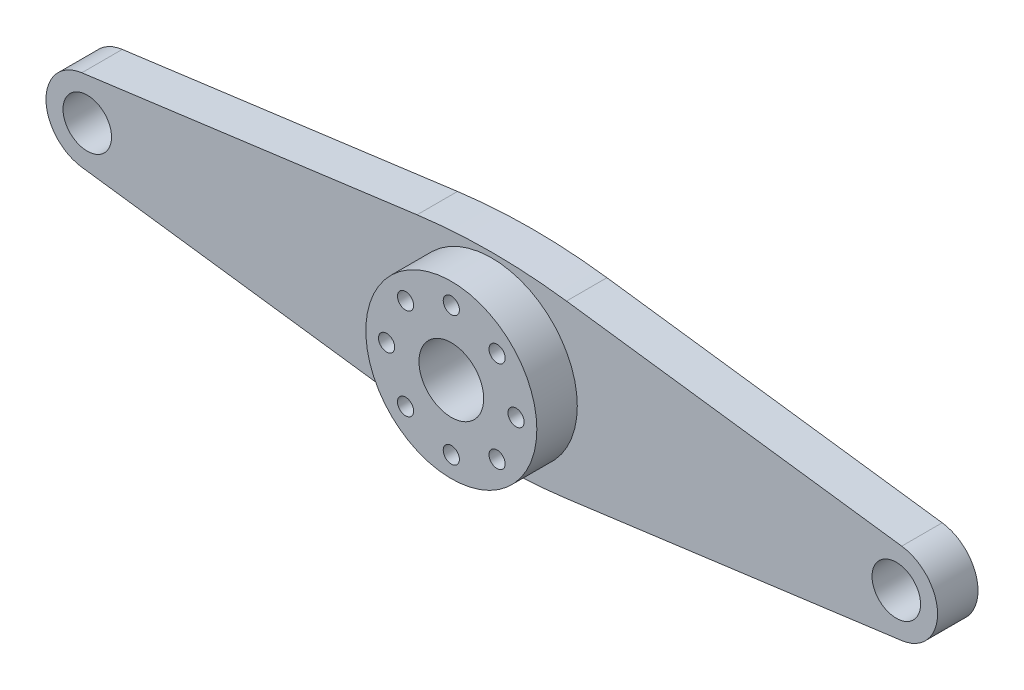
ISO-10303-21;
HEADER;
FILE_DESCRIPTION(('STEP AP214'),'2;1');
FILE_NAME('part.step','',(''),(''),'','','');
FILE_SCHEMA(('AUTOMOTIVE_DESIGN { 1 0 10303 214 1 1 1 1 }'));
ENDSEC;
DATA;
#1=APPLICATION_CONTEXT('core data for automotive mechanical design processes');
#2=APPLICATION_PROTOCOL_DEFINITION('international standard','automotive_design',2000,#1);
#3=PRODUCT_CONTEXT('',#1,'mechanical');
#4=PRODUCT('Part','Part','',(#3));
#5=PRODUCT_RELATED_PRODUCT_CATEGORY('part','',(#4));
#6=PRODUCT_DEFINITION_FORMATION('','',#4);
#7=PRODUCT_DEFINITION_CONTEXT('part definition',#1,'design');
#8=PRODUCT_DEFINITION('design','',#6,#7);
#9=PRODUCT_DEFINITION_SHAPE('','',#8);
#10=(LENGTH_UNIT() NAMED_UNIT(*) SI_UNIT(.MILLI.,.METRE.));
#11=(NAMED_UNIT(*) PLANE_ANGLE_UNIT() SI_UNIT($,.RADIAN.));
#12=(NAMED_UNIT(*) SI_UNIT($,.STERADIAN.) SOLID_ANGLE_UNIT());
#13=UNCERTAINTY_MEASURE_WITH_UNIT(LENGTH_MEASURE(1.E-05),#10,'distance_accuracy_value','');
#14=(GEOMETRIC_REPRESENTATION_CONTEXT(3) GLOBAL_UNCERTAINTY_ASSIGNED_CONTEXT((#13)) GLOBAL_UNIT_ASSIGNED_CONTEXT((#10,
#11,#12)) REPRESENTATION_CONTEXT('',''));
#15=CARTESIAN_POINT('',(0.,0.,0.));
#16=DIRECTION('',(0.,0.,1.));
#17=DIRECTION('',(1.,0.,0.));
#18=AXIS2_PLACEMENT_3D('',#15,#16,#17);
#19=CARTESIAN_POINT('',(-1.54315479575544,-11.5945134987938,5.));
#20=DIRECTION('',(0.131930166805804,0.991259013117456,0.));
#21=DIRECTION('',(-0.991259013117456,0.131930166805804,0.));
#22=AXIS2_PLACEMENT_3D('',#19,#20,#21);
#23=PLANE('',#22);
#24=DIRECTION('',(0.991259013117456,-0.131930166805804,0.));
#25=VECTOR('',#24,1.);
#26=CARTESIAN_POINT('',(-1.54315479575544,-11.5945134987938,0.));
#27=LINE('',#26,#25);
#28=CARTESIAN_POINT('',(-50.6728763500851,-5.05566515137672,0.));
#29=VERTEX_POINT('',#28);
#30=CARTESIAN_POINT('',(-9.23511167640649,-10.5707637614413,0.));
#31=VERTEX_POINT('',#30);
#32=EDGE_CURVE('E135',#29,#31,#27,.T.);
#33=ORIENTED_EDGE('',*,*,#32,.T.);
#34=DIRECTION('',(0.,0.,-1.));
#35=VECTOR('',#34,1.);
#36=CARTESIAN_POINT('',(-9.23511167640649,-10.5707637614413,5.));
#37=LINE('',#36,#35);
#38=CARTESIAN_POINT('',(-9.23511167640649,-10.5707637614413,5.));
#39=VERTEX_POINT('',#38);
#40=EDGE_CURVE('E11',#39,#31,#37,.T.);
#41=ORIENTED_EDGE('',*,*,#40,.F.);
#42=DIRECTION('',(0.991259013117456,-0.131930166805804,0.));
#43=VECTOR('',#42,1.);
#44=CARTESIAN_POINT('',(-1.54315479575544,-11.5945134987938,5.));
#45=LINE('',#44,#43);
#46=CARTESIAN_POINT('',(-50.6728763500851,-5.05566515137672,5.));
#47=VERTEX_POINT('',#46);
#48=EDGE_CURVE('E208',#47,#39,#45,.T.);
#49=ORIENTED_EDGE('',*,*,#48,.F.);
#50=DIRECTION('',(0.,0.,-1.));
#51=VECTOR('',#50,1.);
#52=CARTESIAN_POINT('',(-50.6728763500851,-5.05566515137672,5.));
#53=LINE('',#52,#51);
#54=EDGE_CURVE('E124',#47,#29,#53,.T.);
#55=ORIENTED_EDGE('',*,*,#54,.T.);
#56=EDGE_LOOP('',(#33,#41,#49,#55));
#57=FACE_BOUND('',#56,.T.);
#58=ADVANCED_FACE('F32',(#57),#23,.F.);
#59=CARTESIAN_POINT('',(0.,58.8173671567806,5.));
#60=DIRECTION('',(0.,0.,-1.));
#61=DIRECTION('',(-1.,0.,0.));
#62=AXIS2_PLACEMENT_3D('',#59,#60,#61);
#63=CYLINDRICAL_SURFACE('',#62,70.);
#64=CARTESIAN_POINT('',(0.,58.8173671567806,0.));
#65=DIRECTION('',(0.,0.,1.));
#66=DIRECTION('',(1.,0.,0.));
#67=AXIS2_PLACEMENT_3D('',#64,#65,#66);
#68=CIRCLE('',#67,70.);
#69=CARTESIAN_POINT('',(9.23511167640649,-10.5707637614413,0.));
#70=VERTEX_POINT('',#69);
#71=EDGE_CURVE('E138',#31,#70,#68,.T.);
#72=ORIENTED_EDGE('',*,*,#71,.T.);
#73=DIRECTION('',(0.,0.,-1.));
#74=VECTOR('',#73,1.);
#75=CARTESIAN_POINT('',(9.23511167640649,-10.5707637614413,5.));
#76=LINE('',#75,#74);
#77=CARTESIAN_POINT('',(9.23511167640649,-10.5707637614413,5.));
#78=VERTEX_POINT('',#77);
#79=EDGE_CURVE('E41',#78,#70,#76,.T.);
#80=ORIENTED_EDGE('',*,*,#79,.F.);
#81=CARTESIAN_POINT('',(0.,58.8173671567806,5.));
#82=DIRECTION('',(0.,0.,1.));
#83=DIRECTION('',(1.,0.,0.));
#84=AXIS2_PLACEMENT_3D('',#81,#82,#83);
#85=CIRCLE('',#84,70.);
#86=EDGE_CURVE('E88',#39,#78,#85,.T.);
#87=ORIENTED_EDGE('',*,*,#86,.F.);
#88=ORIENTED_EDGE('',*,*,#40,.T.);
#89=EDGE_LOOP('',(#72,#80,#87,#88));
#90=FACE_BOUND('',#89,.T.);
#91=ADVANCED_FACE('F194',(#90),#63,.T.);
#92=CARTESIAN_POINT('',(1.54315479575544,-11.5945134987938,5.));
#93=DIRECTION('',(0.131930166805804,-0.991259013117456,0.));
#94=DIRECTION('',(0.991259013117456,0.131930166805804,0.));
#95=AXIS2_PLACEMENT_3D('',#92,#93,#94);
#96=PLANE('',#95);
#97=DIRECTION('',(-0.991259013117456,-0.131930166805804,0.));
#98=VECTOR('',#97,1.);
#99=CARTESIAN_POINT('',(1.54315479575544,-11.5945134987938,0.));
#100=LINE('',#99,#98);
#101=CARTESIAN_POINT('',(50.6728763500851,-5.05566515137672,0.));
#102=VERTEX_POINT('',#101);
#103=EDGE_CURVE('E141',#102,#70,#100,.T.);
#104=ORIENTED_EDGE('',*,*,#103,.F.);
#105=DIRECTION('',(0.,0.,-1.));
#106=VECTOR('',#105,1.);
#107=CARTESIAN_POINT('',(50.6728763500851,-5.05566515137672,5.));
#108=LINE('',#107,#106);
#109=CARTESIAN_POINT('',(50.6728763500851,-5.05566515137672,5.));
#110=VERTEX_POINT('',#109);
#111=EDGE_CURVE('E187',#110,#102,#108,.T.);
#112=ORIENTED_EDGE('',*,*,#111,.F.);
#113=DIRECTION('',(-0.991259013117456,-0.131930166805804,0.));
#114=VECTOR('',#113,1.);
#115=CARTESIAN_POINT('',(1.54315479575544,-11.5945134987938,5.));
#116=LINE('',#115,#114);
#117=EDGE_CURVE('E193',#110,#78,#116,.T.);
#118=ORIENTED_EDGE('',*,*,#117,.T.);
#119=ORIENTED_EDGE('',*,*,#79,.T.);
#120=EDGE_LOOP('',(#104,#112,#118,#119));
#121=FACE_BOUND('',#120,.T.);
#122=ADVANCED_FACE('F191',(#121),#96,.T.);
#123=CARTESIAN_POINT('',(50.,0.,5.));
#124=DIRECTION('',(0.,0.,-1.));
#125=DIRECTION('',(-1.,0.,0.));
#126=AXIS2_PLACEMENT_3D('',#123,#124,#125);
#127=CYLINDRICAL_SURFACE('',#126,5.10024633771241);
#128=CARTESIAN_POINT('',(50.,0.,0.));
#129=DIRECTION('',(0.,0.,1.));
#130=DIRECTION('',(1.,0.,0.));
#131=AXIS2_PLACEMENT_3D('',#128,#129,#130);
#132=CIRCLE('',#131,5.10024633771241);
#133=CARTESIAN_POINT('',(50.6728763500851,5.05566515137672,0.));
#134=VERTEX_POINT('',#133);
#135=EDGE_CURVE('E144',#134,#102,#132,.F.);
#136=ORIENTED_EDGE('',*,*,#135,.F.);
#137=DIRECTION('',(0.,0.,-1.));
#138=VECTOR('',#137,1.);
#139=CARTESIAN_POINT('',(50.6728763500851,5.05566515137672,5.));
#140=LINE('',#139,#138);
#141=CARTESIAN_POINT('',(50.6728763500851,5.05566515137672,5.));
#142=VERTEX_POINT('',#141);
#143=EDGE_CURVE('E185',#142,#134,#140,.T.);
#144=ORIENTED_EDGE('',*,*,#143,.F.);
#145=CARTESIAN_POINT('',(50.,0.,5.));
#146=DIRECTION('',(0.,0.,1.));
#147=DIRECTION('',(1.,0.,0.));
#148=AXIS2_PLACEMENT_3D('',#145,#146,#147);
#149=CIRCLE('',#148,5.10024633771241);
#150=EDGE_CURVE('E205',#142,#110,#149,.F.);
#151=ORIENTED_EDGE('',*,*,#150,.T.);
#152=ORIENTED_EDGE('',*,*,#111,.T.);
#153=EDGE_LOOP('',(#136,#144,#151,#152));
#154=FACE_BOUND('',#153,.T.);
#155=ADVANCED_FACE('F203',(#154),#127,.T.);
#156=CARTESIAN_POINT('',(1.54315479575544,11.5945134987938,5.));
#157=DIRECTION('',(-0.131930166805804,-0.991259013117456,0.));
#158=DIRECTION('',(0.991259013117456,-0.131930166805804,0.));
#159=AXIS2_PLACEMENT_3D('',#156,#157,#158);
#160=PLANE('',#159);
#161=DIRECTION('',(-0.991259013117456,0.131930166805804,0.));
#162=VECTOR('',#161,1.);
#163=CARTESIAN_POINT('',(1.54315479575544,11.5945134987938,0.));
#164=LINE('',#163,#162);
#165=CARTESIAN_POINT('',(9.23511167640649,10.5707637614413,0.));
#166=VERTEX_POINT('',#165);
#167=EDGE_CURVE('E147',#134,#166,#164,.T.);
#168=ORIENTED_EDGE('',*,*,#167,.T.);
#169=DIRECTION('',(0.,0.,-1.));
#170=VECTOR('',#169,1.);
#171=CARTESIAN_POINT('',(9.23511167640649,10.5707637614413,5.));
#172=LINE('',#171,#170);
#173=CARTESIAN_POINT('',(9.23511167640649,10.5707637614413,5.));
#174=VERTEX_POINT('',#173);
#175=EDGE_CURVE('E113',#174,#166,#172,.T.);
#176=ORIENTED_EDGE('',*,*,#175,.F.);
#177=DIRECTION('',(-0.991259013117456,0.131930166805804,0.));
#178=VECTOR('',#177,1.);
#179=CARTESIAN_POINT('',(1.54315479575544,11.5945134987938,5.));
#180=LINE('',#179,#178);
#181=EDGE_CURVE('E119',#142,#174,#180,.T.);
#182=ORIENTED_EDGE('',*,*,#181,.F.);
#183=ORIENTED_EDGE('',*,*,#143,.T.);
#184=EDGE_LOOP('',(#168,#176,#182,#183));
#185=FACE_BOUND('',#184,.T.);
#186=ADVANCED_FACE('F353',(#185),#160,.F.);
#187=CARTESIAN_POINT('',(0.,-58.8173671567806,5.));
#188=DIRECTION('',(0.,0.,-1.));
#189=DIRECTION('',(-1.,0.,0.));
#190=AXIS2_PLACEMENT_3D('',#187,#188,#189);
#191=CYLINDRICAL_SURFACE('',#190,70.);
#192=CARTESIAN_POINT('',(0.,-58.8173671567806,0.));
#193=DIRECTION('',(0.,0.,1.));
#194=DIRECTION('',(1.,0.,0.));
#195=AXIS2_PLACEMENT_3D('',#192,#193,#194);
#196=CIRCLE('',#195,70.);
#197=CARTESIAN_POINT('',(-9.23511167640649,10.5707637614413,0.));
#198=VERTEX_POINT('',#197);
#199=EDGE_CURVE('E108',#198,#166,#196,.F.);
#200=ORIENTED_EDGE('',*,*,#199,.F.);
#201=DIRECTION('',(0.,0.,-1.));
#202=VECTOR('',#201,1.);
#203=CARTESIAN_POINT('',(-9.23511167640649,10.5707637614413,5.));
#204=LINE('',#203,#202);
#205=CARTESIAN_POINT('',(-9.23511167640649,10.5707637614413,5.));
#206=VERTEX_POINT('',#205);
#207=EDGE_CURVE('E103',#206,#198,#204,.T.);
#208=ORIENTED_EDGE('',*,*,#207,.F.);
#209=CARTESIAN_POINT('',(0.,-58.8173671567806,5.));
#210=DIRECTION('',(0.,0.,1.));
#211=DIRECTION('',(1.,0.,0.));
#212=AXIS2_PLACEMENT_3D('',#209,#210,#211);
#213=CIRCLE('',#212,70.);
#214=EDGE_CURVE('E106',#206,#174,#213,.F.);
#215=ORIENTED_EDGE('',*,*,#214,.T.);
#216=ORIENTED_EDGE('',*,*,#175,.T.);
#217=EDGE_LOOP('',(#200,#208,#215,#216));
#218=FACE_BOUND('',#217,.T.);
#219=ADVANCED_FACE('F105',(#218),#191,.T.);
#220=CARTESIAN_POINT('',(-1.54315479575544,11.5945134987938,5.));
#221=DIRECTION('',(-0.131930166805804,0.991259013117456,0.));
#222=DIRECTION('',(-0.991259013117456,-0.131930166805804,0.));
#223=AXIS2_PLACEMENT_3D('',#220,#221,#222);
#224=PLANE('',#223);
#225=DIRECTION('',(0.991259013117456,0.131930166805804,0.));
#226=VECTOR('',#225,1.);
#227=CARTESIAN_POINT('',(-1.54315479575544,11.5945134987938,0.));
#228=LINE('',#227,#226);
#229=CARTESIAN_POINT('',(-50.6728763500851,5.05566515137672,0.));
#230=VERTEX_POINT('',#229);
#231=EDGE_CURVE('E151',#230,#198,#228,.T.);
#232=ORIENTED_EDGE('',*,*,#231,.F.);
#233=DIRECTION('',(0.,0.,-1.));
#234=VECTOR('',#233,1.);
#235=CARTESIAN_POINT('',(-50.6728763500851,5.05566515137672,5.));
#236=LINE('',#235,#234);
#237=CARTESIAN_POINT('',(-50.6728763500851,5.05566515137672,5.));
#238=VERTEX_POINT('',#237);
#239=EDGE_CURVE('E77',#238,#230,#236,.T.);
#240=ORIENTED_EDGE('',*,*,#239,.F.);
#241=DIRECTION('',(0.991259013117456,0.131930166805804,0.));
#242=VECTOR('',#241,1.);
#243=CARTESIAN_POINT('',(-1.54315479575544,11.5945134987938,5.));
#244=LINE('',#243,#242);
#245=EDGE_CURVE('E116',#238,#206,#244,.T.);
#246=ORIENTED_EDGE('',*,*,#245,.T.);
#247=ORIENTED_EDGE('',*,*,#207,.T.);
#248=EDGE_LOOP('',(#232,#240,#246,#247));
#249=FACE_BOUND('',#248,.T.);
#250=ADVANCED_FACE('F122',(#249),#224,.T.);
#251=CARTESIAN_POINT('',(0.,-8.,5.));
#252=DIRECTION('',(0.,0.,-1.));
#253=DIRECTION('',(-1.,0.,0.));
#254=AXIS2_PLACEMENT_3D('',#251,#252,#253);
#255=CYLINDRICAL_SURFACE('',#254,1.);
#256=CARTESIAN_POINT('',(0.,-8.,0.));
#257=DIRECTION('',(0.,0.,1.));
#258=DIRECTION('',(1.,0.,0.));
#259=AXIS2_PLACEMENT_3D('',#256,#257,#258);
#260=CIRCLE('',#259,1.);
#261=CARTESIAN_POINT('',(0.999999999999915,-8.,0.));
#262=VERTEX_POINT('',#261);
#263=EDGE_CURVE('E175',#262,#262,#260,.T.);
#264=ORIENTED_EDGE('',*,*,#263,.F.);
#265=EDGE_LOOP('',(#264));
#266=FACE_BOUND('',#265,.T.);
#267=CARTESIAN_POINT('',(0.,-8.,10.));
#268=DIRECTION('',(0.,0.,1.));
#269=DIRECTION('',(1.,0.,0.));
#270=AXIS2_PLACEMENT_3D('',#267,#268,#269);
#271=CIRCLE('',#270,1.);
#272=CARTESIAN_POINT('',(0.999999999999915,-8.,10.));
#273=VERTEX_POINT('',#272);
#274=EDGE_CURVE('E225',#273,#273,#271,.T.);
#275=ORIENTED_EDGE('',*,*,#274,.T.);
#276=EDGE_LOOP('',(#275));
#277=FACE_BOUND('',#276,.T.);
#278=ADVANCED_FACE('F318',(#266,#277),#255,.F.);
#279=CARTESIAN_POINT('',(5.65685424949233,-5.65685424949243,5.));
#280=DIRECTION('',(0.,0.,-1.));
#281=DIRECTION('',(-1.,0.,0.));
#282=AXIS2_PLACEMENT_3D('',#279,#280,#281);
#283=CYLINDRICAL_SURFACE('',#282,1.);
#284=CARTESIAN_POINT('',(5.65685424949233,-5.65685424949243,0.));
#285=DIRECTION('',(0.,0.,1.));
#286=DIRECTION('',(1.,0.,0.));
#287=AXIS2_PLACEMENT_3D('',#284,#285,#286);
#288=CIRCLE('',#287,1.);
#289=CARTESIAN_POINT('',(6.65685424949233,-5.65685424949243,0.));
#290=VERTEX_POINT('',#289);
#291=EDGE_CURVE('E172',#290,#290,#288,.T.);
#292=ORIENTED_EDGE('',*,*,#291,.F.);
#293=EDGE_LOOP('',(#292));
#294=FACE_BOUND('',#293,.T.);
#295=CARTESIAN_POINT('',(5.65685424949233,-5.65685424949243,10.));
#296=DIRECTION('',(0.,0.,1.));
#297=DIRECTION('',(1.,0.,0.));
#298=AXIS2_PLACEMENT_3D('',#295,#296,#297);
#299=CIRCLE('',#298,1.);
#300=CARTESIAN_POINT('',(6.65685424949233,-5.65685424949243,10.));
#301=VERTEX_POINT('',#300);
#302=EDGE_CURVE('E228',#301,#301,#299,.T.);
#303=ORIENTED_EDGE('',*,*,#302,.T.);
#304=EDGE_LOOP('',(#303));
#305=FACE_BOUND('',#304,.T.);
#306=ADVANCED_FACE('F321',(#294,#305),#283,.F.);
#307=CARTESIAN_POINT('',(8.,0.,5.));
#308=DIRECTION('',(0.,0.,-1.));
#309=DIRECTION('',(-1.,0.,0.));
#310=AXIS2_PLACEMENT_3D('',#307,#308,#309);
#311=CYLINDRICAL_SURFACE('',#310,0.999999999999999);
#312=CARTESIAN_POINT('',(8.,0.,0.));
#313=DIRECTION('',(0.,0.,1.));
#314=DIRECTION('',(1.,0.,0.));
#315=AXIS2_PLACEMENT_3D('',#312,#313,#314);
#316=CIRCLE('',#315,0.999999999999999);
#317=CARTESIAN_POINT('',(9.,0.,0.));
#318=VERTEX_POINT('',#317);
#319=EDGE_CURVE('E169',#318,#318,#316,.T.);
#320=ORIENTED_EDGE('',*,*,#319,.F.);
#321=EDGE_LOOP('',(#320));
#322=FACE_BOUND('',#321,.T.);
#323=CARTESIAN_POINT('',(8.,0.,10.));
#324=DIRECTION('',(0.,0.,1.));
#325=DIRECTION('',(1.,0.,0.));
#326=AXIS2_PLACEMENT_3D('',#323,#324,#325);
#327=CIRCLE('',#326,0.999999999999999);
#328=CARTESIAN_POINT('',(9.,0.,10.));
#329=VERTEX_POINT('',#328);
#330=EDGE_CURVE('E231',#329,#329,#327,.T.);
#331=ORIENTED_EDGE('',*,*,#330,.T.);
#332=EDGE_LOOP('',(#331));
#333=FACE_BOUND('',#332,.T.);
#334=ADVANCED_FACE('F325',(#322,#333),#311,.F.);
#335=CARTESIAN_POINT('',(5.65685424949241,5.65685424949235,5.));
#336=DIRECTION('',(0.,0.,-1.));
#337=DIRECTION('',(-1.,0.,0.));
#338=AXIS2_PLACEMENT_3D('',#335,#336,#337);
#339=CYLINDRICAL_SURFACE('',#338,0.999999999999999);
#340=CARTESIAN_POINT('',(5.65685424949241,5.65685424949235,0.));
#341=DIRECTION('',(0.,0.,1.));
#342=DIRECTION('',(1.,0.,0.));
#343=AXIS2_PLACEMENT_3D('',#340,#341,#342);
#344=CIRCLE('',#343,0.999999999999999);
#345=CARTESIAN_POINT('',(6.65685424949241,5.65685424949235,0.));
#346=VERTEX_POINT('',#345);
#347=EDGE_CURVE('E166',#346,#346,#344,.T.);
#348=ORIENTED_EDGE('',*,*,#347,.F.);
#349=EDGE_LOOP('',(#348));
#350=FACE_BOUND('',#349,.T.);
#351=CARTESIAN_POINT('',(5.65685424949241,5.65685424949235,10.));
#352=DIRECTION('',(0.,0.,1.));
#353=DIRECTION('',(1.,0.,0.));
#354=AXIS2_PLACEMENT_3D('',#351,#352,#353);
#355=CIRCLE('',#354,0.999999999999999);
#356=CARTESIAN_POINT('',(6.65685424949241,5.65685424949235,10.));
#357=VERTEX_POINT('',#356);
#358=EDGE_CURVE('E234',#357,#357,#355,.T.);
#359=ORIENTED_EDGE('',*,*,#358,.T.);
#360=EDGE_LOOP('',(#359));
#361=FACE_BOUND('',#360,.T.);
#362=ADVANCED_FACE('F329',(#350,#361),#339,.F.);
#363=CARTESIAN_POINT('',(0.,8.,5.));
#364=DIRECTION('',(0.,0.,-1.));
#365=DIRECTION('',(-1.,0.,0.));
#366=AXIS2_PLACEMENT_3D('',#363,#364,#365);
#367=CYLINDRICAL_SURFACE('',#366,1.);
#368=CARTESIAN_POINT('',(0.,8.,0.));
#369=DIRECTION('',(0.,0.,1.));
#370=DIRECTION('',(1.,0.,0.));
#371=AXIS2_PLACEMENT_3D('',#368,#369,#370);
#372=CIRCLE('',#371,1.);
#373=CARTESIAN_POINT('',(1.00000000000003,8.,0.));
#374=VERTEX_POINT('',#373);
#375=EDGE_CURVE('E163',#374,#374,#372,.T.);
#376=ORIENTED_EDGE('',*,*,#375,.F.);
#377=EDGE_LOOP('',(#376));
#378=FACE_BOUND('',#377,.T.);
#379=CARTESIAN_POINT('',(0.,8.,10.));
#380=DIRECTION('',(0.,0.,1.));
#381=DIRECTION('',(1.,0.,0.));
#382=AXIS2_PLACEMENT_3D('',#379,#380,#381);
#383=CIRCLE('',#382,1.);
#384=CARTESIAN_POINT('',(1.00000000000003,8.,10.));
#385=VERTEX_POINT('',#384);
#386=EDGE_CURVE('E237',#385,#385,#383,.T.);
#387=ORIENTED_EDGE('',*,*,#386,.T.);
#388=EDGE_LOOP('',(#387));
#389=FACE_BOUND('',#388,.T.);
#390=ADVANCED_FACE('F333',(#378,#389),#367,.F.);
#391=CARTESIAN_POINT('',(-8.,0.,5.));
#392=DIRECTION('',(0.,0.,-1.));
#393=DIRECTION('',(-1.,0.,0.));
#394=AXIS2_PLACEMENT_3D('',#391,#392,#393);
#395=CYLINDRICAL_SURFACE('',#394,1.);
#396=CARTESIAN_POINT('',(-8.,0.,0.));
#397=DIRECTION('',(0.,0.,1.));
#398=DIRECTION('',(1.,0.,0.));
#399=AXIS2_PLACEMENT_3D('',#396,#397,#398);
#400=CIRCLE('',#399,1.);
#401=CARTESIAN_POINT('',(-7.,0.,0.));
#402=VERTEX_POINT('',#401);
#403=EDGE_CURVE('E160',#402,#402,#400,.T.);
#404=ORIENTED_EDGE('',*,*,#403,.F.);
#405=EDGE_LOOP('',(#404));
#406=FACE_BOUND('',#405,.T.);
#407=CARTESIAN_POINT('',(-8.,0.,10.));
#408=DIRECTION('',(0.,0.,1.));
#409=DIRECTION('',(1.,0.,0.));
#410=AXIS2_PLACEMENT_3D('',#407,#408,#409);
#411=CIRCLE('',#410,1.);
#412=CARTESIAN_POINT('',(-7.,0.,10.));
#413=VERTEX_POINT('',#412);
#414=EDGE_CURVE('E240',#413,#413,#411,.T.);
#415=ORIENTED_EDGE('',*,*,#414,.T.);
#416=EDGE_LOOP('',(#415));
#417=FACE_BOUND('',#416,.T.);
#418=ADVANCED_FACE('F337',(#406,#417),#395,.F.);
#419=CARTESIAN_POINT('',(-5.65685424949237,5.65685424949239,5.));
#420=DIRECTION('',(0.,0.,-1.));
#421=DIRECTION('',(-1.,0.,0.));
#422=AXIS2_PLACEMENT_3D('',#419,#420,#421);
#423=CYLINDRICAL_SURFACE('',#422,0.999999999999999);
#424=CARTESIAN_POINT('',(-5.65685424949237,5.65685424949239,0.));
#425=DIRECTION('',(0.,0.,1.));
#426=DIRECTION('',(1.,0.,0.));
#427=AXIS2_PLACEMENT_3D('',#424,#425,#426);
#428=CIRCLE('',#427,0.999999999999999);
#429=CARTESIAN_POINT('',(-4.65685424949237,5.65685424949239,0.));
#430=VERTEX_POINT('',#429);
#431=EDGE_CURVE('E157',#430,#430,#428,.T.);
#432=ORIENTED_EDGE('',*,*,#431,.F.);
#433=EDGE_LOOP('',(#432));
#434=FACE_BOUND('',#433,.T.);
#435=CARTESIAN_POINT('',(-5.65685424949237,5.65685424949239,10.));
#436=DIRECTION('',(0.,0.,1.));
#437=DIRECTION('',(1.,0.,0.));
#438=AXIS2_PLACEMENT_3D('',#435,#436,#437);
#439=CIRCLE('',#438,0.999999999999999);
#440=CARTESIAN_POINT('',(-4.65685424949237,5.65685424949239,10.));
#441=VERTEX_POINT('',#440);
#442=EDGE_CURVE('E243',#441,#441,#439,.T.);
#443=ORIENTED_EDGE('',*,*,#442,.T.);
#444=EDGE_LOOP('',(#443));
#445=FACE_BOUND('',#444,.T.);
#446=ADVANCED_FACE('F341',(#434,#445),#423,.F.);
#447=CARTESIAN_POINT('',(0.,0.,5.));
#448=DIRECTION('',(0.,0.,-1.));
#449=DIRECTION('',(-1.,0.,0.));
#450=AXIS2_PLACEMENT_3D('',#447,#448,#449);
#451=CYLINDRICAL_SURFACE('',#450,4.);
#452=CARTESIAN_POINT('',(0.,0.,0.));
#453=DIRECTION('',(0.,0.,1.));
#454=DIRECTION('',(1.,0.,0.));
#455=AXIS2_PLACEMENT_3D('',#452,#453,#454);
#456=CIRCLE('',#455,4.);
#457=CARTESIAN_POINT('',(4.,0.,0.));
#458=VERTEX_POINT('',#457);
#459=EDGE_CURVE('E154',#458,#458,#456,.T.);
#460=ORIENTED_EDGE('',*,*,#459,.F.);
#461=EDGE_LOOP('',(#460));
#462=FACE_BOUND('',#461,.T.);
#463=CARTESIAN_POINT('',(0.,0.,10.));
#464=DIRECTION('',(0.,0.,1.));
#465=DIRECTION('',(1.,0.,0.));
#466=AXIS2_PLACEMENT_3D('',#463,#464,#465);
#467=CIRCLE('',#466,4.);
#468=CARTESIAN_POINT('',(4.,0.,10.));
#469=VERTEX_POINT('',#468);
#470=EDGE_CURVE('E246',#469,#469,#467,.T.);
#471=ORIENTED_EDGE('',*,*,#470,.T.);
#472=EDGE_LOOP('',(#471));
#473=FACE_BOUND('',#472,.T.);
#474=ADVANCED_FACE('F250',(#462,#473),#451,.F.);
#475=CARTESIAN_POINT('',(-50.,0.,5.));
#476=DIRECTION('',(0.,0.,-1.));
#477=DIRECTION('',(-1.,0.,0.));
#478=AXIS2_PLACEMENT_3D('',#475,#476,#477);
#479=CYLINDRICAL_SURFACE('',#478,5.10024633771241);
#480=CARTESIAN_POINT('',(-50.,0.,0.));
#481=DIRECTION('',(0.,0.,1.));
#482=DIRECTION('',(1.,0.,0.));
#483=AXIS2_PLACEMENT_3D('',#480,#481,#482);
#484=CIRCLE('',#483,5.10024633771241);
#485=EDGE_CURVE('E80',#230,#29,#484,.T.);
#486=ORIENTED_EDGE('',*,*,#485,.T.);
#487=ORIENTED_EDGE('',*,*,#54,.F.);
#488=CARTESIAN_POINT('',(-50.,0.,5.));
#489=DIRECTION('',(0.,0.,1.));
#490=DIRECTION('',(1.,0.,0.));
#491=AXIS2_PLACEMENT_3D('',#488,#489,#490);
#492=CIRCLE('',#491,5.10024633771241);
#493=EDGE_CURVE('E49',#238,#47,#492,.T.);
#494=ORIENTED_EDGE('',*,*,#493,.F.);
#495=ORIENTED_EDGE('',*,*,#239,.T.);
#496=EDGE_LOOP('',(#486,#487,#494,#495));
#497=FACE_BOUND('',#496,.T.);
#498=ADVANCED_FACE('F295',(#497),#479,.T.);
#499=CARTESIAN_POINT('',(-50.,0.,5.));
#500=DIRECTION('',(0.,0.,-1.));
#501=DIRECTION('',(-1.,0.,0.));
#502=AXIS2_PLACEMENT_3D('',#499,#500,#501);
#503=CYLINDRICAL_SURFACE('',#502,3.);
#504=CARTESIAN_POINT('',(-50.,0.,5.));
#505=DIRECTION('',(0.,0.,1.));
#506=DIRECTION('',(1.,0.,0.));
#507=AXIS2_PLACEMENT_3D('',#504,#505,#506);
#508=CIRCLE('',#507,3.);
#509=CARTESIAN_POINT('',(-47.,0.,5.));
#510=VERTEX_POINT('',#509);
#511=EDGE_CURVE('E212',#510,#510,#508,.T.);
#512=ORIENTED_EDGE('',*,*,#511,.T.);
#513=EDGE_LOOP('',(#512));
#514=FACE_BOUND('',#513,.T.);
#515=CARTESIAN_POINT('',(-50.,0.,0.));
#516=DIRECTION('',(0.,0.,1.));
#517=DIRECTION('',(1.,0.,0.));
#518=AXIS2_PLACEMENT_3D('',#515,#516,#517);
#519=CIRCLE('',#518,3.);
#520=CARTESIAN_POINT('',(-47.,0.,0.));
#521=VERTEX_POINT('',#520);
#522=EDGE_CURVE('E131',#521,#521,#519,.T.);
#523=ORIENTED_EDGE('',*,*,#522,.F.);
#524=EDGE_LOOP('',(#523));
#525=FACE_BOUND('',#524,.T.);
#526=ADVANCED_FACE('F293',(#514,#525),#503,.F.);
#527=CARTESIAN_POINT('',(50.,0.,5.));
#528=DIRECTION('',(0.,0.,-1.));
#529=DIRECTION('',(-1.,0.,0.));
#530=AXIS2_PLACEMENT_3D('',#527,#528,#529);
#531=CYLINDRICAL_SURFACE('',#530,3.);
#532=CARTESIAN_POINT('',(50.,0.,5.));
#533=DIRECTION('',(0.,0.,1.));
#534=DIRECTION('',(1.,0.,0.));
#535=AXIS2_PLACEMENT_3D('',#532,#533,#534);
#536=CIRCLE('',#535,3.);
#537=CARTESIAN_POINT('',(53.,0.,5.));
#538=VERTEX_POINT('',#537);
#539=EDGE_CURVE('E181',#538,#538,#536,.F.);
#540=ORIENTED_EDGE('',*,*,#539,.F.);
#541=EDGE_LOOP('',(#540));
#542=FACE_BOUND('',#541,.T.);
#543=CARTESIAN_POINT('',(50.,0.,0.));
#544=DIRECTION('',(0.,0.,1.));
#545=DIRECTION('',(1.,0.,0.));
#546=AXIS2_PLACEMENT_3D('',#543,#544,#545);
#547=CIRCLE('',#546,3.);
#548=CARTESIAN_POINT('',(53.,0.,0.));
#549=VERTEX_POINT('',#548);
#550=EDGE_CURVE('E128',#549,#549,#547,.F.);
#551=ORIENTED_EDGE('',*,*,#550,.T.);
#552=EDGE_LOOP('',(#551));
#553=FACE_BOUND('',#552,.T.);
#554=ADVANCED_FACE('F34',(#542,#553),#531,.F.);
#555=CARTESIAN_POINT('',(-5.65685424949245,-5.65685424949231,5.));
#556=DIRECTION('',(0.,0.,-1.));
#557=DIRECTION('',(-1.,0.,0.));
#558=AXIS2_PLACEMENT_3D('',#555,#556,#557);
#559=CYLINDRICAL_SURFACE('',#558,1.);
#560=CARTESIAN_POINT('',(-5.65685424949245,-5.65685424949231,0.));
#561=DIRECTION('',(0.,0.,1.));
#562=DIRECTION('',(1.,0.,0.));
#563=AXIS2_PLACEMENT_3D('',#560,#561,#562);
#564=CIRCLE('',#563,1.);
#565=CARTESIAN_POINT('',(-4.65685424949245,-5.65685424949231,0.));
#566=VERTEX_POINT('',#565);
#567=EDGE_CURVE('E178',#566,#566,#564,.T.);
#568=ORIENTED_EDGE('',*,*,#567,.F.);
#569=EDGE_LOOP('',(#568));
#570=FACE_BOUND('',#569,.T.);
#571=CARTESIAN_POINT('',(-5.65685424949245,-5.65685424949231,10.));
#572=DIRECTION('',(0.,0.,1.));
#573=DIRECTION('',(1.,0.,0.));
#574=AXIS2_PLACEMENT_3D('',#571,#572,#573);
#575=CIRCLE('',#574,1.);
#576=CARTESIAN_POINT('',(-4.65685424949245,-5.65685424949231,10.));
#577=VERTEX_POINT('',#576);
#578=EDGE_CURVE('E222',#577,#577,#575,.T.);
#579=ORIENTED_EDGE('',*,*,#578,.T.);
#580=EDGE_LOOP('',(#579));
#581=FACE_BOUND('',#580,.T.);
#582=ADVANCED_FACE('F301',(#570,#581),#559,.F.);
#583=CARTESIAN_POINT('',(0.,0.,5.));
#584=DIRECTION('',(0.,0.,1.));
#585=DIRECTION('',(1.,0.,0.));
#586=AXIS2_PLACEMENT_3D('',#583,#584,#585);
#587=PLANE('',#586);
#588=CARTESIAN_POINT('',(0.,0.,5.));
#589=DIRECTION('',(0.,0.,1.));
#590=DIRECTION('',(1.,0.,0.));
#591=AXIS2_PLACEMENT_3D('',#588,#589,#590);
#592=CIRCLE('',#591,10.5707637614413);
#593=CARTESIAN_POINT('',(10.5707637614413,0.,5.));
#594=VERTEX_POINT('',#593);
#595=EDGE_CURVE('E132',#594,#594,#592,.F.);
#596=ORIENTED_EDGE('',*,*,#595,.T.);
#597=EDGE_LOOP('',(#596));
#598=FACE_BOUND('',#597,.T.);
#599=ORIENTED_EDGE('',*,*,#539,.T.);
#600=EDGE_LOOP('',(#599));
#601=FACE_BOUND('',#600,.T.);
#602=ORIENTED_EDGE('',*,*,#511,.F.);
#603=EDGE_LOOP('',(#602));
#604=FACE_BOUND('',#603,.T.);
#605=ORIENTED_EDGE('',*,*,#48,.T.);
#606=ORIENTED_EDGE('',*,*,#86,.T.);
#607=ORIENTED_EDGE('',*,*,#117,.F.);
#608=ORIENTED_EDGE('',*,*,#150,.F.);
#609=ORIENTED_EDGE('',*,*,#181,.T.);
#610=ORIENTED_EDGE('',*,*,#214,.F.);
#611=ORIENTED_EDGE('',*,*,#245,.F.);
#612=ORIENTED_EDGE('',*,*,#493,.T.);
#613=EDGE_LOOP('',(#605,#606,#607,#608,#609,#610,#611,#612));
#614=FACE_BOUND('',#613,.T.);
#615=ADVANCED_FACE('F115',(#598,#601,#604,#614),#587,.T.);
#616=CARTESIAN_POINT('',(0.,0.,0.));
#617=DIRECTION('',(0.,0.,1.));
#618=DIRECTION('',(1.,0.,0.));
#619=AXIS2_PLACEMENT_3D('',#616,#617,#618);
#620=PLANE('',#619);
#621=ORIENTED_EDGE('',*,*,#550,.F.);
#622=EDGE_LOOP('',(#621));
#623=FACE_BOUND('',#622,.T.);
#624=ORIENTED_EDGE('',*,*,#522,.T.);
#625=EDGE_LOOP('',(#624));
#626=FACE_BOUND('',#625,.T.);
#627=ORIENTED_EDGE('',*,*,#32,.F.);
#628=ORIENTED_EDGE('',*,*,#485,.F.);
#629=ORIENTED_EDGE('',*,*,#231,.T.);
#630=ORIENTED_EDGE('',*,*,#199,.T.);
#631=ORIENTED_EDGE('',*,*,#167,.F.);
#632=ORIENTED_EDGE('',*,*,#135,.T.);
#633=ORIENTED_EDGE('',*,*,#103,.T.);
#634=ORIENTED_EDGE('',*,*,#71,.F.);
#635=EDGE_LOOP('',(#627,#628,#629,#630,#631,#632,#633,#634));
#636=FACE_BOUND('',#635,.T.);
#637=ORIENTED_EDGE('',*,*,#567,.T.);
#638=EDGE_LOOP('',(#637));
#639=FACE_BOUND('',#638,.T.);
#640=ORIENTED_EDGE('',*,*,#263,.T.);
#641=EDGE_LOOP('',(#640));
#642=FACE_BOUND('',#641,.T.);
#643=ORIENTED_EDGE('',*,*,#291,.T.);
#644=EDGE_LOOP('',(#643));
#645=FACE_BOUND('',#644,.T.);
#646=ORIENTED_EDGE('',*,*,#319,.T.);
#647=EDGE_LOOP('',(#646));
#648=FACE_BOUND('',#647,.T.);
#649=ORIENTED_EDGE('',*,*,#347,.T.);
#650=EDGE_LOOP('',(#649));
#651=FACE_BOUND('',#650,.T.);
#652=ORIENTED_EDGE('',*,*,#375,.T.);
#653=EDGE_LOOP('',(#652));
#654=FACE_BOUND('',#653,.T.);
#655=ORIENTED_EDGE('',*,*,#403,.T.);
#656=EDGE_LOOP('',(#655));
#657=FACE_BOUND('',#656,.T.);
#658=ORIENTED_EDGE('',*,*,#431,.T.);
#659=EDGE_LOOP('',(#658));
#660=FACE_BOUND('',#659,.T.);
#661=ORIENTED_EDGE('',*,*,#459,.T.);
#662=EDGE_LOOP('',(#661));
#663=FACE_BOUND('',#662,.T.);
#664=ADVANCED_FACE('F198',(#623,#626,#636,#639,#642,#645,#648,#651,#654,#657,#660,#663),#620,.F.);
#665=CARTESIAN_POINT('',(0.,0.,10.));
#666=DIRECTION('',(0.,0.,-1.));
#667=DIRECTION('',(-1.,0.,0.));
#668=AXIS2_PLACEMENT_3D('',#665,#666,#667);
#669=CYLINDRICAL_SURFACE('',#668,10.5707637614413);
#670=ORIENTED_EDGE('',*,*,#595,.F.);
#671=EDGE_LOOP('',(#670));
#672=FACE_BOUND('',#671,.T.);
#673=CARTESIAN_POINT('',(0.,0.,10.));
#674=DIRECTION('',(0.,0.,1.));
#675=DIRECTION('',(1.,0.,0.));
#676=AXIS2_PLACEMENT_3D('',#673,#674,#675);
#677=CIRCLE('',#676,10.5707637614413);
#678=CARTESIAN_POINT('',(10.5707637614413,0.,10.));
#679=VERTEX_POINT('',#678);
#680=EDGE_CURVE('E219',#679,#679,#677,.T.);
#681=ORIENTED_EDGE('',*,*,#680,.F.);
#682=EDGE_LOOP('',(#681));
#683=FACE_BOUND('',#682,.T.);
#684=ADVANCED_FACE('F255',(#672,#683),#669,.T.);
#685=CARTESIAN_POINT('',(0.,0.,10.));
#686=DIRECTION('',(0.,0.,1.));
#687=DIRECTION('',(1.,0.,0.));
#688=AXIS2_PLACEMENT_3D('',#685,#686,#687);
#689=PLANE('',#688);
#690=ORIENTED_EDGE('',*,*,#470,.F.);
#691=EDGE_LOOP('',(#690));
#692=FACE_BOUND('',#691,.T.);
#693=ORIENTED_EDGE('',*,*,#442,.F.);
#694=EDGE_LOOP('',(#693));
#695=FACE_BOUND('',#694,.T.);
#696=ORIENTED_EDGE('',*,*,#414,.F.);
#697=EDGE_LOOP('',(#696));
#698=FACE_BOUND('',#697,.T.);
#699=ORIENTED_EDGE('',*,*,#386,.F.);
#700=EDGE_LOOP('',(#699));
#701=FACE_BOUND('',#700,.T.);
#702=ORIENTED_EDGE('',*,*,#358,.F.);
#703=EDGE_LOOP('',(#702));
#704=FACE_BOUND('',#703,.T.);
#705=ORIENTED_EDGE('',*,*,#330,.F.);
#706=EDGE_LOOP('',(#705));
#707=FACE_BOUND('',#706,.T.);
#708=ORIENTED_EDGE('',*,*,#302,.F.);
#709=EDGE_LOOP('',(#708));
#710=FACE_BOUND('',#709,.T.);
#711=ORIENTED_EDGE('',*,*,#274,.F.);
#712=EDGE_LOOP('',(#711));
#713=FACE_BOUND('',#712,.T.);
#714=ORIENTED_EDGE('',*,*,#578,.F.);
#715=EDGE_LOOP('',(#714));
#716=FACE_BOUND('',#715,.T.);
#717=ORIENTED_EDGE('',*,*,#680,.T.);
#718=EDGE_LOOP('',(#717));
#719=FACE_BOUND('',#718,.T.);
#720=ADVANCED_FACE('F252',(#692,#695,#698,#701,#704,#707,#710,#713,#716,#719),#689,.T.);
#721=CLOSED_SHELL('',(#58,#91,#122,#155,#186,#219,#250,#278,#306,#334,#362,#390,#418,#446,#474,
#498,#526,#554,#582,#615,#664,#684,#720));
#722=MANIFOLD_SOLID_BREP('B2',#721);
#723=ADVANCED_BREP_SHAPE_REPRESENTATION('',(#18,#722),#14);
#724=SHAPE_DEFINITION_REPRESENTATION(#9,#723);
ENDSEC;
END-ISO-10303-21;
